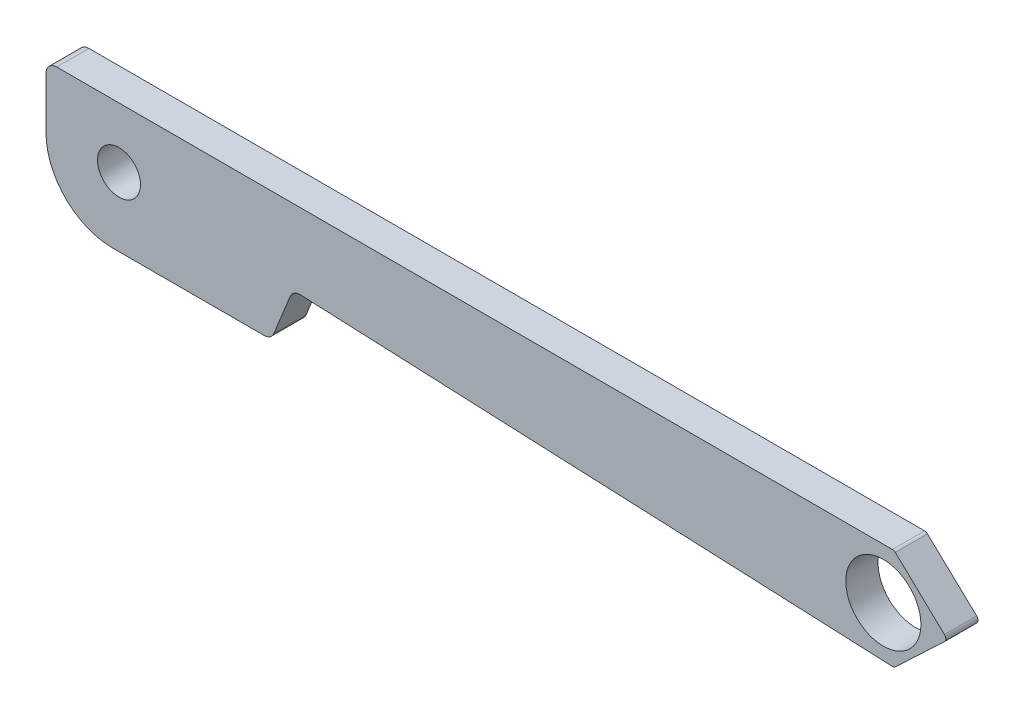
ISO-10303-21;
HEADER;
FILE_DESCRIPTION(('STEP AP214'),'2;1');
FILE_NAME('part.step','',(''),(''),'','','');
FILE_SCHEMA(('AUTOMOTIVE_DESIGN { 1 0 10303 214 1 1 1 1 }'));
ENDSEC;
DATA;
#1=APPLICATION_CONTEXT('core data for automotive mechanical design processes');
#2=APPLICATION_PROTOCOL_DEFINITION('international standard','automotive_design',2000,#1);
#3=PRODUCT_CONTEXT('',#1,'mechanical');
#4=PRODUCT('Part','Part','',(#3));
#5=PRODUCT_RELATED_PRODUCT_CATEGORY('part','',(#4));
#6=PRODUCT_DEFINITION_FORMATION('','',#4);
#7=PRODUCT_DEFINITION_CONTEXT('part definition',#1,'design');
#8=PRODUCT_DEFINITION('design','',#6,#7);
#9=PRODUCT_DEFINITION_SHAPE('','',#8);
#10=(LENGTH_UNIT() NAMED_UNIT(*) SI_UNIT(.MILLI.,.METRE.));
#11=(NAMED_UNIT(*) PLANE_ANGLE_UNIT() SI_UNIT($,.RADIAN.));
#12=(NAMED_UNIT(*) SI_UNIT($,.STERADIAN.) SOLID_ANGLE_UNIT());
#13=UNCERTAINTY_MEASURE_WITH_UNIT(LENGTH_MEASURE(1.E-05),#10,'distance_accuracy_value','');
#14=(GEOMETRIC_REPRESENTATION_CONTEXT(3) GLOBAL_UNCERTAINTY_ASSIGNED_CONTEXT((#13)) GLOBAL_UNIT_ASSIGNED_CONTEXT((#10,
#11,#12)) REPRESENTATION_CONTEXT('',''));
#15=CARTESIAN_POINT('',(0.,0.,0.));
#16=DIRECTION('',(0.,0.,1.));
#17=DIRECTION('',(1.,0.,0.));
#18=AXIS2_PLACEMENT_3D('',#15,#16,#17);
#19=CARTESIAN_POINT('',(0.,0.,1.5));
#20=DIRECTION('',(0.,0.,-1.));
#21=DIRECTION('',(-1.,0.,0.));
#22=AXIS2_PLACEMENT_3D('',#19,#20,#21);
#23=PLANE('',#22);
#24=CARTESIAN_POINT('',(3.4,3.2,1.5));
#25=DIRECTION('',(0.,0.,1.));
#26=DIRECTION('',(1.,0.,0.));
#27=AXIS2_PLACEMENT_3D('',#24,#25,#26);
#28=CIRCLE('',#27,0.999999999999999);
#29=CARTESIAN_POINT('',(4.4,3.2,1.5));
#30=VERTEX_POINT('',#29);
#31=EDGE_CURVE('E270',#30,#30,#28,.T.);
#32=ORIENTED_EDGE('',*,*,#31,.F.);
#33=EDGE_LOOP('',(#32));
#34=FACE_BOUND('',#33,.T.);
#35=DIRECTION('',(0.,-1.,0.));
#36=VECTOR('',#35,1.);
#37=CARTESIAN_POINT('',(0.,0.,1.5));
#38=LINE('',#37,#36);
#39=CARTESIAN_POINT('',(0.,5.5,1.5));
#40=VERTEX_POINT('',#39);
#41=CARTESIAN_POINT('',(0.,3.1,1.5));
#42=VERTEX_POINT('',#41);
#43=EDGE_CURVE('E148',#40,#42,#38,.T.);
#44=ORIENTED_EDGE('',*,*,#43,.T.);
#45=CARTESIAN_POINT('',(3.1,3.1,1.5));
#46=DIRECTION('',(0.,0.,-1.));
#47=DIRECTION('',(-1.,0.,0.));
#48=AXIS2_PLACEMENT_3D('',#45,#46,#47);
#49=CIRCLE('',#48,3.1);
#50=CARTESIAN_POINT('',(3.1,0.,1.5));
#51=VERTEX_POINT('',#50);
#52=EDGE_CURVE('E11',#42,#51,#49,.F.);
#53=ORIENTED_EDGE('',*,*,#52,.T.);
#54=DIRECTION('',(1.,0.,0.));
#55=VECTOR('',#54,1.);
#56=CARTESIAN_POINT('',(10.4899344354121,0.,1.5));
#57=LINE('',#56,#55);
#58=CARTESIAN_POINT('',(10.1526801769909,0.,1.5));
#59=VERTEX_POINT('',#58);
#60=EDGE_CURVE('E152',#51,#59,#57,.T.);
#61=ORIENTED_EDGE('',*,*,#60,.T.);
#62=CARTESIAN_POINT('',(10.1526801769909,0.5,1.5));
#63=DIRECTION('',(0.,0.,-1.));
#64=DIRECTION('',(-1.,0.,0.));
#65=AXIS2_PLACEMENT_3D('',#62,#63,#64);
#66=CIRCLE('',#65,0.5);
#67=CARTESIAN_POINT('',(10.6162721042743,0.312696703292046,1.5));
#68=VERTEX_POINT('',#67);
#69=EDGE_CURVE('E164',#59,#68,#66,.F.);
#70=ORIENTED_EDGE('',*,*,#69,.T.);
#71=DIRECTION('',(0.37460659341591,0.927183854566788,0.));
#72=VECTOR('',#71,1.);
#73=CARTESIAN_POINT('',(11.5,2.5,1.5));
#74=LINE('',#73,#72);
#75=CARTESIAN_POINT('',(11.3676271173199,2.17236561832966,1.5));
#76=VERTEX_POINT('',#75);
#77=EDGE_CURVE('E155',#68,#76,#74,.T.);
#78=ORIENTED_EDGE('',*,*,#77,.T.);
#79=CARTESIAN_POINT('',(11.8312190446033,1.98506232162171,1.5));
#80=DIRECTION('',(0.,0.,-1.));
#81=DIRECTION('',(-1.,0.,0.));
#82=AXIS2_PLACEMENT_3D('',#79,#80,#81);
#83=CIRCLE('',#82,0.5);
#84=CARTESIAN_POINT('',(11.853028738286,2.48458643241264,1.5));
#85=VERTEX_POINT('',#84);
#86=EDGE_CURVE('E181',#76,#85,#83,.T.);
#87=ORIENTED_EDGE('',*,*,#86,.T.);
#88=DIRECTION('',(0.999048221581858,-0.0436193873653287,0.));
#89=VECTOR('',#88,1.);
#90=CARTESIAN_POINT('',(39.5,1.27749359856187,1.5));
#91=LINE('',#90,#89);
#92=CARTESIAN_POINT('',(39.4154632114129,1.28118455446204,1.5));
#93=VERTEX_POINT('',#92);
#94=EDGE_CURVE('E262',#85,#93,#91,.T.);
#95=ORIENTED_EDGE('',*,*,#94,.T.);
#96=CARTESIAN_POINT('',(39.424187088886,1.48099419877841,1.5));
#97=DIRECTION('',(0.,0.,-1.));
#98=DIRECTION('',(-1.,0.,0.));
#99=AXIS2_PLACEMENT_3D('',#96,#97,#98);
#100=CIRCLE('',#99,0.2);
#101=CARTESIAN_POINT('',(39.5615161632574,1.33559569351688,1.5));
#102=VERTEX_POINT('',#101);
#103=EDGE_CURVE('E200',#93,#102,#100,.F.);
#104=ORIENTED_EDGE('',*,*,#103,.T.);
#105=DIRECTION('',(0.726992526307661,0.686645371857121,0.));
#106=VECTOR('',#105,1.);
#107=CARTESIAN_POINT('',(42.,3.63874679928093,1.5));
#108=LINE('',#107,#106);
#109=CARTESIAN_POINT('',(41.8460579055888,3.4933482940194,1.5));
#110=VERTEX_POINT('',#109);
#111=EDGE_CURVE('E257',#102,#110,#108,.T.);
#112=ORIENTED_EDGE('',*,*,#111,.T.);
#113=CARTESIAN_POINT('',(41.7087288312174,3.63874679928093,1.5));
#114=DIRECTION('',(0.,0.,-1.));
#115=DIRECTION('',(-1.,0.,0.));
#116=AXIS2_PLACEMENT_3D('',#113,#114,#115);
#117=CIRCLE('',#116,0.2);
#118=CARTESIAN_POINT('',(41.8460579055888,3.78414530454246,1.5));
#119=VERTEX_POINT('',#118);
#120=EDGE_CURVE('E198',#110,#119,#117,.F.);
#121=ORIENTED_EDGE('',*,*,#120,.T.);
#122=DIRECTION('',(-0.726992526307661,0.686645371857121,0.));
#123=VECTOR('',#122,1.);
#124=CARTESIAN_POINT('',(39.5,6.,1.5));
#125=LINE('',#124,#123);
#126=CARTESIAN_POINT('',(39.5578098684227,5.94539850526153,1.5));
#127=VERTEX_POINT('',#126);
#128=EDGE_CURVE('E254',#119,#127,#125,.T.);
#129=ORIENTED_EDGE('',*,*,#128,.T.);
#130=CARTESIAN_POINT('',(39.4204807940512,5.8,1.5));
#131=DIRECTION('',(0.,0.,-1.));
#132=DIRECTION('',(-1.,0.,0.));
#133=AXIS2_PLACEMENT_3D('',#130,#131,#132);
#134=CIRCLE('',#133,0.2);
#135=CARTESIAN_POINT('',(39.4204807940512,6.,1.5));
#136=VERTEX_POINT('',#135);
#137=EDGE_CURVE('E196',#127,#136,#134,.F.);
#138=ORIENTED_EDGE('',*,*,#137,.T.);
#139=DIRECTION('',(-1.,0.,0.));
#140=VECTOR('',#139,1.);
#141=CARTESIAN_POINT('',(0.,6.,1.5));
#142=LINE('',#141,#140);
#143=CARTESIAN_POINT('',(0.5,6.,1.5));
#144=VERTEX_POINT('',#143);
#145=EDGE_CURVE('E253',#136,#144,#142,.T.);
#146=ORIENTED_EDGE('',*,*,#145,.T.);
#147=CARTESIAN_POINT('',(0.5,5.5,1.5));
#148=DIRECTION('',(0.,0.,-1.));
#149=DIRECTION('',(-1.,0.,0.));
#150=AXIS2_PLACEMENT_3D('',#147,#148,#149);
#151=CIRCLE('',#150,0.5);
#152=EDGE_CURVE('E166',#144,#40,#151,.F.);
#153=ORIENTED_EDGE('',*,*,#152,.T.);
#154=EDGE_LOOP('',(#44,#53,#61,#70,#78,#87,#95,#104,#112,#121,#129,#138,#146,#153));
#155=FACE_BOUND('',#154,.T.);
#156=CARTESIAN_POINT('',(39.,3.63874679928093,1.5));
#157=DIRECTION('',(0.,0.,1.));
#158=DIRECTION('',(1.,0.,0.));
#159=AXIS2_PLACEMENT_3D('',#156,#157,#158);
#160=CIRCLE('',#159,1.75);
#161=CARTESIAN_POINT('',(40.75,3.63874679928093,1.5));
#162=VERTEX_POINT('',#161);
#163=EDGE_CURVE('E223',#162,#162,#160,.T.);
#164=ORIENTED_EDGE('',*,*,#163,.F.);
#165=EDGE_LOOP('',(#164));
#166=FACE_BOUND('',#165,.T.);
#167=ADVANCED_FACE('F34',(#34,#155,#166),#23,.F.);
#168=CARTESIAN_POINT('',(0.,0.,0.));
#169=DIRECTION('',(0.,0.,-1.));
#170=DIRECTION('',(-1.,0.,0.));
#171=AXIS2_PLACEMENT_3D('',#168,#169,#170);
#172=PLANE('',#171);
#173=CARTESIAN_POINT('',(3.4,3.2,0.));
#174=DIRECTION('',(0.,0.,1.));
#175=DIRECTION('',(1.,0.,0.));
#176=AXIS2_PLACEMENT_3D('',#173,#174,#175);
#177=CIRCLE('',#176,0.999999999999999);
#178=CARTESIAN_POINT('',(4.4,3.2,0.));
#179=VERTEX_POINT('',#178);
#180=EDGE_CURVE('E268',#179,#179,#177,.T.);
#181=ORIENTED_EDGE('',*,*,#180,.T.);
#182=EDGE_LOOP('',(#181));
#183=FACE_BOUND('',#182,.T.);
#184=DIRECTION('',(1.,0.,0.));
#185=VECTOR('',#184,1.);
#186=CARTESIAN_POINT('',(10.4899344354121,0.,0.));
#187=LINE('',#186,#185);
#188=CARTESIAN_POINT('',(3.1,0.,0.));
#189=VERTEX_POINT('',#188);
#190=CARTESIAN_POINT('',(10.1526801769909,0.,0.));
#191=VERTEX_POINT('',#190);
#192=EDGE_CURVE('E217',#189,#191,#187,.T.);
#193=ORIENTED_EDGE('',*,*,#192,.F.);
#194=CARTESIAN_POINT('',(3.1,3.1,0.));
#195=DIRECTION('',(0.,0.,-1.));
#196=DIRECTION('',(-1.,0.,0.));
#197=AXIS2_PLACEMENT_3D('',#194,#195,#196);
#198=CIRCLE('',#197,3.1);
#199=CARTESIAN_POINT('',(0.,3.1,0.));
#200=VERTEX_POINT('',#199);
#201=EDGE_CURVE('E56',#189,#200,#198,.T.);
#202=ORIENTED_EDGE('',*,*,#201,.T.);
#203=DIRECTION('',(0.,-1.,0.));
#204=VECTOR('',#203,1.);
#205=CARTESIAN_POINT('',(0.,0.,0.));
#206=LINE('',#205,#204);
#207=CARTESIAN_POINT('',(0.,5.5,0.));
#208=VERTEX_POINT('',#207);
#209=EDGE_CURVE('E147',#208,#200,#206,.T.);
#210=ORIENTED_EDGE('',*,*,#209,.F.);
#211=CARTESIAN_POINT('',(0.5,5.5,0.));
#212=DIRECTION('',(0.,0.,-1.));
#213=DIRECTION('',(-1.,0.,0.));
#214=AXIS2_PLACEMENT_3D('',#211,#212,#213);
#215=CIRCLE('',#214,0.5);
#216=CARTESIAN_POINT('',(0.5,6.,0.));
#217=VERTEX_POINT('',#216);
#218=EDGE_CURVE('E136',#208,#217,#215,.T.);
#219=ORIENTED_EDGE('',*,*,#218,.T.);
#220=DIRECTION('',(-1.,0.,0.));
#221=VECTOR('',#220,1.);
#222=CARTESIAN_POINT('',(0.,6.,0.));
#223=LINE('',#222,#221);
#224=CARTESIAN_POINT('',(39.4204807940512,6.,0.));
#225=VERTEX_POINT('',#224);
#226=EDGE_CURVE('E153',#225,#217,#223,.T.);
#227=ORIENTED_EDGE('',*,*,#226,.F.);
#228=CARTESIAN_POINT('',(39.4204807940512,5.8,0.));
#229=DIRECTION('',(0.,0.,-1.));
#230=DIRECTION('',(-1.,0.,0.));
#231=AXIS2_PLACEMENT_3D('',#228,#229,#230);
#232=CIRCLE('',#231,0.2);
#233=CARTESIAN_POINT('',(39.5578098684227,5.94539850526153,0.));
#234=VERTEX_POINT('',#233);
#235=EDGE_CURVE('E188',#225,#234,#232,.T.);
#236=ORIENTED_EDGE('',*,*,#235,.T.);
#237=DIRECTION('',(-0.726992526307661,0.686645371857121,0.));
#238=VECTOR('',#237,1.);
#239=CARTESIAN_POINT('',(39.5,6.,0.));
#240=LINE('',#239,#238);
#241=CARTESIAN_POINT('',(41.8460579055888,3.78414530454246,0.));
#242=VERTEX_POINT('',#241);
#243=EDGE_CURVE('E157',#242,#234,#240,.T.);
#244=ORIENTED_EDGE('',*,*,#243,.F.);
#245=CARTESIAN_POINT('',(41.7087288312174,3.63874679928093,0.));
#246=DIRECTION('',(0.,0.,-1.));
#247=DIRECTION('',(-1.,0.,0.));
#248=AXIS2_PLACEMENT_3D('',#245,#246,#247);
#249=CIRCLE('',#248,0.2);
#250=CARTESIAN_POINT('',(41.8460579055888,3.4933482940194,0.));
#251=VERTEX_POINT('',#250);
#252=EDGE_CURVE('E190',#242,#251,#249,.T.);
#253=ORIENTED_EDGE('',*,*,#252,.T.);
#254=DIRECTION('',(0.726992526307661,0.686645371857121,0.));
#255=VECTOR('',#254,1.);
#256=CARTESIAN_POINT('',(42.,3.63874679928093,0.));
#257=LINE('',#256,#255);
#258=CARTESIAN_POINT('',(39.5615161632574,1.33559569351688,0.));
#259=VERTEX_POINT('',#258);
#260=EDGE_CURVE('E236',#259,#251,#257,.T.);
#261=ORIENTED_EDGE('',*,*,#260,.F.);
#262=CARTESIAN_POINT('',(39.424187088886,1.48099419877841,0.));
#263=DIRECTION('',(0.,0.,-1.));
#264=DIRECTION('',(-1.,0.,0.));
#265=AXIS2_PLACEMENT_3D('',#262,#263,#264);
#266=CIRCLE('',#265,0.2);
#267=CARTESIAN_POINT('',(39.4154632114129,1.28118455446204,0.));
#268=VERTEX_POINT('',#267);
#269=EDGE_CURVE('E192',#259,#268,#266,.T.);
#270=ORIENTED_EDGE('',*,*,#269,.T.);
#271=DIRECTION('',(0.999048221581858,-0.0436193873653287,0.));
#272=VECTOR('',#271,1.);
#273=CARTESIAN_POINT('',(39.5,1.27749359856187,0.));
#274=LINE('',#273,#272);
#275=CARTESIAN_POINT('',(11.853028738286,2.48458643241264,0.));
#276=VERTEX_POINT('',#275);
#277=EDGE_CURVE('E226',#276,#268,#274,.T.);
#278=ORIENTED_EDGE('',*,*,#277,.F.);
#279=CARTESIAN_POINT('',(11.8312190446033,1.98506232162171,0.));
#280=DIRECTION('',(0.,0.,-1.));
#281=DIRECTION('',(-1.,0.,0.));
#282=AXIS2_PLACEMENT_3D('',#279,#280,#281);
#283=CIRCLE('',#282,0.5);
#284=CARTESIAN_POINT('',(11.3676271173199,2.17236561832966,0.));
#285=VERTEX_POINT('',#284);
#286=EDGE_CURVE('E179',#276,#285,#283,.F.);
#287=ORIENTED_EDGE('',*,*,#286,.T.);
#288=DIRECTION('',(0.37460659341591,0.927183854566788,0.));
#289=VECTOR('',#288,1.);
#290=CARTESIAN_POINT('',(11.5,2.5,0.));
#291=LINE('',#290,#289);
#292=CARTESIAN_POINT('',(10.6162721042743,0.312696703292046,0.));
#293=VERTEX_POINT('',#292);
#294=EDGE_CURVE('E222',#293,#285,#291,.T.);
#295=ORIENTED_EDGE('',*,*,#294,.F.);
#296=CARTESIAN_POINT('',(10.1526801769909,0.5,0.));
#297=DIRECTION('',(0.,0.,-1.));
#298=DIRECTION('',(-1.,0.,0.));
#299=AXIS2_PLACEMENT_3D('',#296,#297,#298);
#300=CIRCLE('',#299,0.5);
#301=EDGE_CURVE('E144',#293,#191,#300,.T.);
#302=ORIENTED_EDGE('',*,*,#301,.T.);
#303=EDGE_LOOP('',(#193,#202,#210,#219,#227,#236,#244,#253,#261,#270,#278,#287,#295,#302));
#304=FACE_BOUND('',#303,.T.);
#305=CARTESIAN_POINT('',(39.,3.63874679928093,0.));
#306=DIRECTION('',(0.,0.,1.));
#307=DIRECTION('',(1.,0.,0.));
#308=AXIS2_PLACEMENT_3D('',#305,#306,#307);
#309=CIRCLE('',#308,1.75);
#310=CARTESIAN_POINT('',(40.75,3.63874679928093,0.));
#311=VERTEX_POINT('',#310);
#312=EDGE_CURVE('E229',#311,#311,#309,.T.);
#313=ORIENTED_EDGE('',*,*,#312,.T.);
#314=EDGE_LOOP('',(#313));
#315=FACE_BOUND('',#314,.T.);
#316=ADVANCED_FACE('F150',(#183,#304,#315),#172,.T.);
#317=CARTESIAN_POINT('',(10.4899344354121,0.,1.5));
#318=DIRECTION('',(0.,1.,0.));
#319=DIRECTION('',(0.,0.,1.));
#320=AXIS2_PLACEMENT_3D('',#317,#318,#319);
#321=PLANE('',#320);
#322=ORIENTED_EDGE('',*,*,#60,.F.);
#323=DIRECTION('',(0.,0.,-1.));
#324=VECTOR('',#323,1.);
#325=CARTESIAN_POINT('',(3.1,0.,1.5));
#326=LINE('',#325,#324);
#327=EDGE_CURVE('E210',#51,#189,#326,.T.);
#328=ORIENTED_EDGE('',*,*,#327,.T.);
#329=ORIENTED_EDGE('',*,*,#192,.T.);
#330=DIRECTION('',(0.,0.,-1.));
#331=VECTOR('',#330,1.);
#332=CARTESIAN_POINT('',(10.1526801769909,0.,1.5));
#333=LINE('',#332,#331);
#334=EDGE_CURVE('E173',#191,#59,#333,.F.);
#335=ORIENTED_EDGE('',*,*,#334,.T.);
#336=EDGE_LOOP('',(#322,#328,#329,#335));
#337=FACE_BOUND('',#336,.T.);
#338=ADVANCED_FACE('F216',(#337),#321,.F.);
#339=CARTESIAN_POINT('',(11.5,2.5,1.5));
#340=DIRECTION('',(-0.927183854566789,0.37460659341591,0.));
#341=DIRECTION('',(-0.37460659341591,-0.927183854566789,0.));
#342=AXIS2_PLACEMENT_3D('',#339,#340,#341);
#343=PLANE('',#342);
#344=ORIENTED_EDGE('',*,*,#77,.F.);
#345=DIRECTION('',(0.,0.,-1.));
#346=VECTOR('',#345,1.);
#347=CARTESIAN_POINT('',(10.6162721042743,0.312696703292045,1.5));
#348=LINE('',#347,#346);
#349=EDGE_CURVE('E170',#68,#293,#348,.T.);
#350=ORIENTED_EDGE('',*,*,#349,.T.);
#351=ORIENTED_EDGE('',*,*,#294,.T.);
#352=DIRECTION('',(0.,0.,-1.));
#353=VECTOR('',#352,1.);
#354=CARTESIAN_POINT('',(11.3676271173199,2.17236561832966,1.5));
#355=LINE('',#354,#353);
#356=EDGE_CURVE('E168',#285,#76,#355,.F.);
#357=ORIENTED_EDGE('',*,*,#356,.T.);
#358=EDGE_LOOP('',(#344,#350,#351,#357));
#359=FACE_BOUND('',#358,.T.);
#360=ADVANCED_FACE('F305',(#359),#343,.F.);
#361=CARTESIAN_POINT('',(39.5,1.27749359856187,1.5));
#362=DIRECTION('',(0.0436193873653287,0.999048221581858,0.));
#363=DIRECTION('',(-0.999048221581858,0.0436193873653287,0.));
#364=AXIS2_PLACEMENT_3D('',#361,#362,#363);
#365=PLANE('',#364);
#366=ORIENTED_EDGE('',*,*,#277,.T.);
#367=DIRECTION('',(0.,0.,-1.));
#368=VECTOR('',#367,1.);
#369=CARTESIAN_POINT('',(39.4154632114129,1.28118455446204,1.5));
#370=LINE('',#369,#368);
#371=EDGE_CURVE('E194',#268,#93,#370,.F.);
#372=ORIENTED_EDGE('',*,*,#371,.T.);
#373=ORIENTED_EDGE('',*,*,#94,.F.);
#374=DIRECTION('',(0.,0.,-1.));
#375=VECTOR('',#374,1.);
#376=CARTESIAN_POINT('',(11.853028738286,2.48458643241264,0.));
#377=LINE('',#376,#375);
#378=EDGE_CURVE('E176',#85,#276,#377,.T.);
#379=ORIENTED_EDGE('',*,*,#378,.T.);
#380=EDGE_LOOP('',(#366,#372,#373,#379));
#381=FACE_BOUND('',#380,.T.);
#382=ADVANCED_FACE('F301',(#381),#365,.F.);
#383=CARTESIAN_POINT('',(42.,3.63874679928093,1.5));
#384=DIRECTION('',(-0.686645371857121,0.726992526307661,0.));
#385=DIRECTION('',(-0.726992526307661,-0.686645371857121,0.));
#386=AXIS2_PLACEMENT_3D('',#383,#384,#385);
#387=PLANE('',#386);
#388=ORIENTED_EDGE('',*,*,#111,.F.);
#389=DIRECTION('',(0.,0.,-1.));
#390=VECTOR('',#389,1.);
#391=CARTESIAN_POINT('',(39.5615161632574,1.33559569351688,1.5));
#392=LINE('',#391,#390);
#393=EDGE_CURVE('E185',#102,#259,#392,.T.);
#394=ORIENTED_EDGE('',*,*,#393,.T.);
#395=ORIENTED_EDGE('',*,*,#260,.T.);
#396=DIRECTION('',(0.,0.,-1.));
#397=VECTOR('',#396,1.);
#398=CARTESIAN_POINT('',(41.8460579055888,3.4933482940194,1.5));
#399=LINE('',#398,#397);
#400=EDGE_CURVE('E183',#251,#110,#399,.F.);
#401=ORIENTED_EDGE('',*,*,#400,.T.);
#402=EDGE_LOOP('',(#388,#394,#395,#401));
#403=FACE_BOUND('',#402,.T.);
#404=ADVANCED_FACE('F298',(#403),#387,.F.);
#405=CARTESIAN_POINT('',(39.5,6.,1.5));
#406=DIRECTION('',(-0.686645371857121,-0.726992526307661,0.));
#407=DIRECTION('',(0.726992526307661,-0.686645371857121,0.));
#408=AXIS2_PLACEMENT_3D('',#405,#406,#407);
#409=PLANE('',#408);
#410=ORIENTED_EDGE('',*,*,#128,.F.);
#411=DIRECTION('',(0.,0.,-1.));
#412=VECTOR('',#411,1.);
#413=CARTESIAN_POINT('',(41.8460579055888,3.78414530454246,1.5));
#414=LINE('',#413,#412);
#415=EDGE_CURVE('E204',#119,#242,#414,.T.);
#416=ORIENTED_EDGE('',*,*,#415,.T.);
#417=ORIENTED_EDGE('',*,*,#243,.T.);
#418=DIRECTION('',(0.,0.,-1.));
#419=VECTOR('',#418,1.);
#420=CARTESIAN_POINT('',(39.5578098684227,5.94539850526153,1.5));
#421=LINE('',#420,#419);
#422=EDGE_CURVE('E202',#234,#127,#421,.F.);
#423=ORIENTED_EDGE('',*,*,#422,.T.);
#424=EDGE_LOOP('',(#410,#416,#417,#423));
#425=FACE_BOUND('',#424,.T.);
#426=ADVANCED_FACE('F243',(#425),#409,.F.);
#427=CARTESIAN_POINT('',(0.,6.,1.5));
#428=DIRECTION('',(0.,-1.,0.));
#429=DIRECTION('',(0.,0.,-1.));
#430=AXIS2_PLACEMENT_3D('',#427,#428,#429);
#431=PLANE('',#430);
#432=ORIENTED_EDGE('',*,*,#145,.F.);
#433=DIRECTION('',(0.,0.,-1.));
#434=VECTOR('',#433,1.);
#435=CARTESIAN_POINT('',(39.4204807940512,6.,1.5));
#436=LINE('',#435,#434);
#437=EDGE_CURVE('E207',#136,#225,#436,.T.);
#438=ORIENTED_EDGE('',*,*,#437,.T.);
#439=ORIENTED_EDGE('',*,*,#226,.T.);
#440=DIRECTION('',(0.,0.,-1.));
#441=VECTOR('',#440,1.);
#442=CARTESIAN_POINT('',(0.5,6.,1.5));
#443=LINE('',#442,#441);
#444=EDGE_CURVE('E142',#217,#144,#443,.F.);
#445=ORIENTED_EDGE('',*,*,#444,.T.);
#446=EDGE_LOOP('',(#432,#438,#439,#445));
#447=FACE_BOUND('',#446,.T.);
#448=ADVANCED_FACE('F256',(#447),#431,.F.);
#449=CARTESIAN_POINT('',(0.,0.,1.5));
#450=DIRECTION('',(1.,0.,0.));
#451=DIRECTION('',(0.,0.,-1.));
#452=AXIS2_PLACEMENT_3D('',#449,#450,#451);
#453=PLANE('',#452);
#454=ORIENTED_EDGE('',*,*,#209,.T.);
#455=DIRECTION('',(0.,0.,-1.));
#456=VECTOR('',#455,1.);
#457=CARTESIAN_POINT('',(0.,3.1,1.5));
#458=LINE('',#457,#456);
#459=EDGE_CURVE('E42',#200,#42,#458,.F.);
#460=ORIENTED_EDGE('',*,*,#459,.T.);
#461=ORIENTED_EDGE('',*,*,#43,.F.);
#462=DIRECTION('',(0.,0.,-1.));
#463=VECTOR('',#462,1.);
#464=CARTESIAN_POINT('',(0.,5.5,1.5));
#465=LINE('',#464,#463);
#466=EDGE_CURVE('E140',#40,#208,#465,.T.);
#467=ORIENTED_EDGE('',*,*,#466,.T.);
#468=EDGE_LOOP('',(#454,#460,#461,#467));
#469=FACE_BOUND('',#468,.T.);
#470=ADVANCED_FACE('F146',(#469),#453,.F.);
#471=CARTESIAN_POINT('',(39.,3.63874679928093,1.5));
#472=DIRECTION('',(0.,0.,-1.));
#473=DIRECTION('',(-1.,0.,0.));
#474=AXIS2_PLACEMENT_3D('',#471,#472,#473);
#475=CYLINDRICAL_SURFACE('',#474,1.75);
#476=ORIENTED_EDGE('',*,*,#163,.T.);
#477=EDGE_LOOP('',(#476));
#478=FACE_BOUND('',#477,.T.);
#479=ORIENTED_EDGE('',*,*,#312,.F.);
#480=EDGE_LOOP('',(#479));
#481=FACE_BOUND('',#480,.T.);
#482=ADVANCED_FACE('F290',(#478,#481),#475,.F.);
#483=CARTESIAN_POINT('',(0.5,5.5,1.5));
#484=DIRECTION('',(0.,0.,-1.));
#485=DIRECTION('',(-1.,0.,0.));
#486=AXIS2_PLACEMENT_3D('',#483,#484,#485);
#487=CYLINDRICAL_SURFACE('',#486,0.5);
#488=ORIENTED_EDGE('',*,*,#152,.F.);
#489=ORIENTED_EDGE('',*,*,#444,.F.);
#490=ORIENTED_EDGE('',*,*,#218,.F.);
#491=ORIENTED_EDGE('',*,*,#466,.F.);
#492=EDGE_LOOP('',(#488,#489,#490,#491));
#493=FACE_BOUND('',#492,.T.);
#494=ADVANCED_FACE('F139',(#493),#487,.T.);
#495=CARTESIAN_POINT('',(10.1526801769909,0.5,1.5));
#496=DIRECTION('',(0.,0.,-1.));
#497=DIRECTION('',(-1.,0.,0.));
#498=AXIS2_PLACEMENT_3D('',#495,#496,#497);
#499=CYLINDRICAL_SURFACE('',#498,0.5);
#500=ORIENTED_EDGE('',*,*,#69,.F.);
#501=ORIENTED_EDGE('',*,*,#334,.F.);
#502=ORIENTED_EDGE('',*,*,#301,.F.);
#503=ORIENTED_EDGE('',*,*,#349,.F.);
#504=EDGE_LOOP('',(#500,#501,#502,#503));
#505=FACE_BOUND('',#504,.T.);
#506=ADVANCED_FACE('F314',(#505),#499,.T.);
#507=CARTESIAN_POINT('',(11.8312190446033,1.98506232162171,1.5));
#508=DIRECTION('',(0.,0.,1.));
#509=DIRECTION('',(1.,0.,0.));
#510=AXIS2_PLACEMENT_3D('',#507,#508,#509);
#511=CYLINDRICAL_SURFACE('',#510,0.5);
#512=ORIENTED_EDGE('',*,*,#86,.F.);
#513=ORIENTED_EDGE('',*,*,#356,.F.);
#514=ORIENTED_EDGE('',*,*,#286,.F.);
#515=ORIENTED_EDGE('',*,*,#378,.F.);
#516=EDGE_LOOP('',(#512,#513,#514,#515));
#517=FACE_BOUND('',#516,.T.);
#518=ADVANCED_FACE('F317',(#517),#511,.F.);
#519=CARTESIAN_POINT('',(39.424187088886,1.48099419877841,1.5));
#520=DIRECTION('',(0.,0.,-1.));
#521=DIRECTION('',(-1.,0.,0.));
#522=AXIS2_PLACEMENT_3D('',#519,#520,#521);
#523=CYLINDRICAL_SURFACE('',#522,0.2);
#524=ORIENTED_EDGE('',*,*,#103,.F.);
#525=ORIENTED_EDGE('',*,*,#371,.F.);
#526=ORIENTED_EDGE('',*,*,#269,.F.);
#527=ORIENTED_EDGE('',*,*,#393,.F.);
#528=EDGE_LOOP('',(#524,#525,#526,#527));
#529=FACE_BOUND('',#528,.T.);
#530=ADVANCED_FACE('F321',(#529),#523,.T.);
#531=CARTESIAN_POINT('',(41.7087288312174,3.63874679928093,1.5));
#532=DIRECTION('',(0.,0.,-1.));
#533=DIRECTION('',(-1.,0.,0.));
#534=AXIS2_PLACEMENT_3D('',#531,#532,#533);
#535=CYLINDRICAL_SURFACE('',#534,0.2);
#536=ORIENTED_EDGE('',*,*,#120,.F.);
#537=ORIENTED_EDGE('',*,*,#400,.F.);
#538=ORIENTED_EDGE('',*,*,#252,.F.);
#539=ORIENTED_EDGE('',*,*,#415,.F.);
#540=EDGE_LOOP('',(#536,#537,#538,#539));
#541=FACE_BOUND('',#540,.T.);
#542=ADVANCED_FACE('F325',(#541),#535,.T.);
#543=CARTESIAN_POINT('',(39.4204807940512,5.8,1.5));
#544=DIRECTION('',(0.,0.,-1.));
#545=DIRECTION('',(-1.,0.,0.));
#546=AXIS2_PLACEMENT_3D('',#543,#544,#545);
#547=CYLINDRICAL_SURFACE('',#546,0.2);
#548=ORIENTED_EDGE('',*,*,#137,.F.);
#549=ORIENTED_EDGE('',*,*,#422,.F.);
#550=ORIENTED_EDGE('',*,*,#235,.F.);
#551=ORIENTED_EDGE('',*,*,#437,.F.);
#552=EDGE_LOOP('',(#548,#549,#550,#551));
#553=FACE_BOUND('',#552,.T.);
#554=ADVANCED_FACE('F248',(#553),#547,.T.);
#555=CARTESIAN_POINT('',(3.4,3.2,0.));
#556=DIRECTION('',(0.,0.,1.));
#557=DIRECTION('',(1.,0.,0.));
#558=AXIS2_PLACEMENT_3D('',#555,#556,#557);
#559=CYLINDRICAL_SURFACE('',#558,0.999999999999999);
#560=ORIENTED_EDGE('',*,*,#180,.F.);
#561=EDGE_LOOP('',(#560));
#562=FACE_BOUND('',#561,.T.);
#563=ORIENTED_EDGE('',*,*,#31,.T.);
#564=EDGE_LOOP('',(#563));
#565=FACE_BOUND('',#564,.T.);
#566=ADVANCED_FACE('F277',(#562,#565),#559,.F.);
#567=CARTESIAN_POINT('',(3.1,3.1,1.5));
#568=DIRECTION('',(0.,0.,-1.));
#569=DIRECTION('',(-1.,0.,0.));
#570=AXIS2_PLACEMENT_3D('',#567,#568,#569);
#571=CYLINDRICAL_SURFACE('',#570,3.1);
#572=ORIENTED_EDGE('',*,*,#52,.F.);
#573=ORIENTED_EDGE('',*,*,#459,.F.);
#574=ORIENTED_EDGE('',*,*,#201,.F.);
#575=ORIENTED_EDGE('',*,*,#327,.F.);
#576=EDGE_LOOP('',(#572,#573,#574,#575));
#577=FACE_BOUND('',#576,.T.);
#578=ADVANCED_FACE('F36',(#577),#571,.T.);
#579=CLOSED_SHELL('',(#167,#316,#338,#360,#382,#404,#426,#448,#470,#482,#494,#506,#518,#530,
#542,#554,#566,#578));
#580=MANIFOLD_SOLID_BREP('B2',#579);
#581=ADVANCED_BREP_SHAPE_REPRESENTATION('',(#18,#580),#14);
#582=SHAPE_DEFINITION_REPRESENTATION(#9,#581);
ENDSEC;
END-ISO-10303-21;
